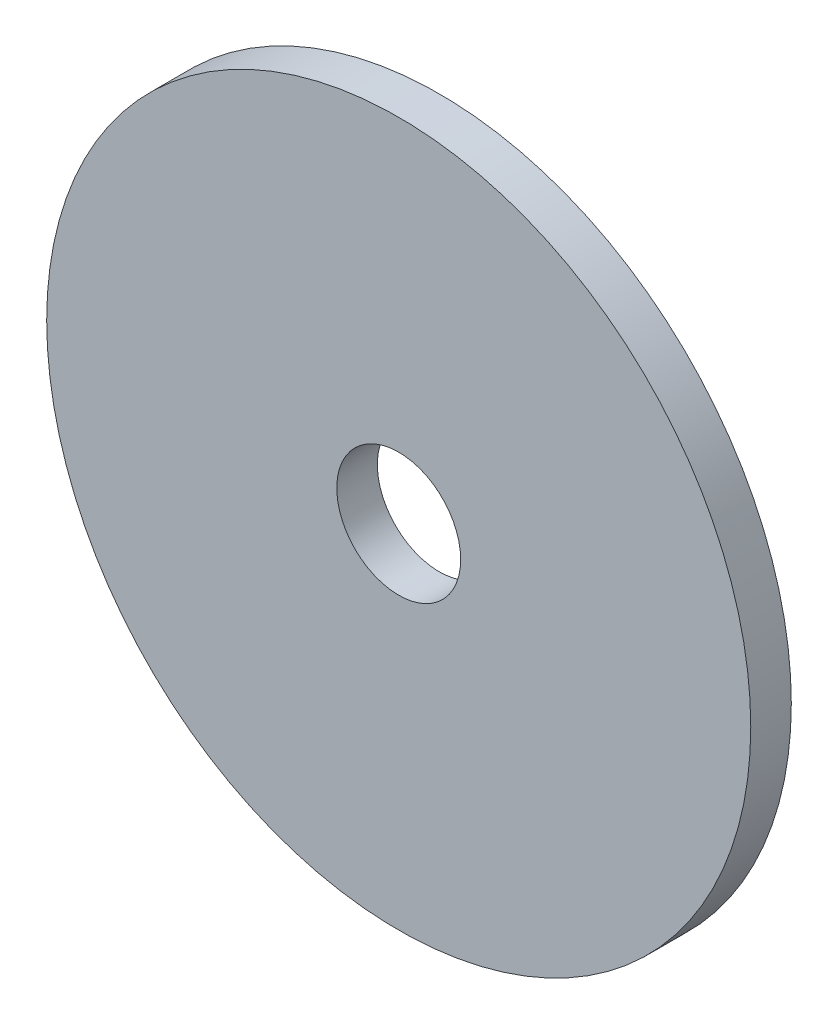
ISO-10303-21;
HEADER;
FILE_DESCRIPTION(('STEP AP214'),'2;1');
FILE_NAME('part.step','',(''),(''),'','','');
FILE_SCHEMA(('AUTOMOTIVE_DESIGN { 1 0 10303 214 1 1 1 1 }'));
ENDSEC;
DATA;
#1=APPLICATION_CONTEXT('core data for automotive mechanical design processes');
#2=APPLICATION_PROTOCOL_DEFINITION('international standard','automotive_design',2000,#1);
#3=PRODUCT_CONTEXT('',#1,'mechanical');
#4=PRODUCT('Part','Part','',(#3));
#5=PRODUCT_RELATED_PRODUCT_CATEGORY('part','',(#4));
#6=PRODUCT_DEFINITION_FORMATION('','',#4);
#7=PRODUCT_DEFINITION_CONTEXT('part definition',#1,'design');
#8=PRODUCT_DEFINITION('design','',#6,#7);
#9=PRODUCT_DEFINITION_SHAPE('','',#8);
#10=(LENGTH_UNIT() NAMED_UNIT(*) SI_UNIT(.MILLI.,.METRE.));
#11=(NAMED_UNIT(*) PLANE_ANGLE_UNIT() SI_UNIT($,.RADIAN.));
#12=(NAMED_UNIT(*) SI_UNIT($,.STERADIAN.) SOLID_ANGLE_UNIT());
#13=UNCERTAINTY_MEASURE_WITH_UNIT(LENGTH_MEASURE(1.E-05),#10,'distance_accuracy_value','');
#14=(GEOMETRIC_REPRESENTATION_CONTEXT(3) GLOBAL_UNCERTAINTY_ASSIGNED_CONTEXT((#13)) GLOBAL_UNIT_ASSIGNED_CONTEXT((#10,
#11,#12)) REPRESENTATION_CONTEXT('',''));
#15=CARTESIAN_POINT('',(0.,0.,0.));
#16=DIRECTION('',(0.,0.,1.));
#17=DIRECTION('',(1.,0.,0.));
#18=AXIS2_PLACEMENT_3D('',#15,#16,#17);
#19=CARTESIAN_POINT('',(0.,0.,1.44));
#20=DIRECTION('',(0.,0.,1.));
#21=DIRECTION('',(1.,0.,0.));
#22=AXIS2_PLACEMENT_3D('',#19,#20,#21);
#23=PLANE('',#22);
#24=CARTESIAN_POINT('',(0.,0.,1.44));
#25=DIRECTION('',(0.,0.,1.));
#26=DIRECTION('',(1.,0.,0.));
#27=AXIS2_PLACEMENT_3D('',#24,#25,#26);
#28=CIRCLE('',#27,12.5);
#29=CARTESIAN_POINT('',(12.5,0.,1.44));
#30=VERTEX_POINT('',#29);
#31=EDGE_CURVE('E10',#30,#30,#28,.T.);
#32=ORIENTED_EDGE('',*,*,#31,.T.);
#33=EDGE_LOOP('',(#32));
#34=FACE_BOUND('',#33,.T.);
#35=CARTESIAN_POINT('',(0.,0.,1.44));
#36=DIRECTION('',(0.,0.,1.));
#37=DIRECTION('',(1.,0.,0.));
#38=AXIS2_PLACEMENT_3D('',#35,#36,#37);
#39=CIRCLE('',#38,2.2);
#40=CARTESIAN_POINT('',(2.2,0.,1.44));
#41=VERTEX_POINT('',#40);
#42=EDGE_CURVE('E48',#41,#41,#39,.T.);
#43=ORIENTED_EDGE('',*,*,#42,.F.);
#44=EDGE_LOOP('',(#43));
#45=FACE_BOUND('',#44,.T.);
#46=ADVANCED_FACE('F37',(#34,#45),#23,.T.);
#47=CARTESIAN_POINT('',(0.,0.,0.));
#48=DIRECTION('',(0.,0.,1.));
#49=DIRECTION('',(1.,0.,0.));
#50=AXIS2_PLACEMENT_3D('',#47,#48,#49);
#51=PLANE('',#50);
#52=CARTESIAN_POINT('',(0.,0.,0.));
#53=DIRECTION('',(0.,0.,1.));
#54=DIRECTION('',(1.,0.,0.));
#55=AXIS2_PLACEMENT_3D('',#52,#53,#54);
#56=CIRCLE('',#55,12.5);
#57=CARTESIAN_POINT('',(12.5,0.,0.));
#58=VERTEX_POINT('',#57);
#59=EDGE_CURVE('E41',#58,#58,#56,.T.);
#60=ORIENTED_EDGE('',*,*,#59,.F.);
#61=EDGE_LOOP('',(#60));
#62=FACE_BOUND('',#61,.T.);
#63=CARTESIAN_POINT('',(0.,0.,0.));
#64=DIRECTION('',(0.,0.,1.));
#65=DIRECTION('',(1.,0.,0.));
#66=AXIS2_PLACEMENT_3D('',#63,#64,#65);
#67=CIRCLE('',#66,2.2);
#68=CARTESIAN_POINT('',(2.2,0.,0.));
#69=VERTEX_POINT('',#68);
#70=EDGE_CURVE('E50',#69,#69,#67,.T.);
#71=ORIENTED_EDGE('',*,*,#70,.T.);
#72=EDGE_LOOP('',(#71));
#73=FACE_BOUND('',#72,.T.);
#74=ADVANCED_FACE('F60',(#62,#73),#51,.F.);
#75=CARTESIAN_POINT('',(0.,0.,1.44));
#76=DIRECTION('',(0.,0.,-1.));
#77=DIRECTION('',(-1.,0.,0.));
#78=AXIS2_PLACEMENT_3D('',#75,#76,#77);
#79=CYLINDRICAL_SURFACE('',#78,12.5);
#80=ORIENTED_EDGE('',*,*,#31,.F.);
#81=EDGE_LOOP('',(#80));
#82=FACE_BOUND('',#81,.T.);
#83=ORIENTED_EDGE('',*,*,#59,.T.);
#84=EDGE_LOOP('',(#83));
#85=FACE_BOUND('',#84,.T.);
#86=ADVANCED_FACE('F39',(#82,#85),#79,.T.);
#87=CARTESIAN_POINT('',(0.,0.,1.44));
#88=DIRECTION('',(0.,0.,-1.));
#89=DIRECTION('',(-1.,0.,0.));
#90=AXIS2_PLACEMENT_3D('',#87,#88,#89);
#91=CYLINDRICAL_SURFACE('',#90,2.2);
#92=ORIENTED_EDGE('',*,*,#42,.T.);
#93=EDGE_LOOP('',(#92));
#94=FACE_BOUND('',#93,.T.);
#95=ORIENTED_EDGE('',*,*,#70,.F.);
#96=EDGE_LOOP('',(#95));
#97=FACE_BOUND('',#96,.T.);
#98=ADVANCED_FACE('F56',(#94,#97),#91,.F.);
#99=CLOSED_SHELL('',(#46,#74,#86,#98));
#100=MANIFOLD_SOLID_BREP('B2',#99);
#101=ADVANCED_BREP_SHAPE_REPRESENTATION('',(#18,#100),#14);
#102=SHAPE_DEFINITION_REPRESENTATION(#9,#101);
ENDSEC;
END-ISO-10303-21;
